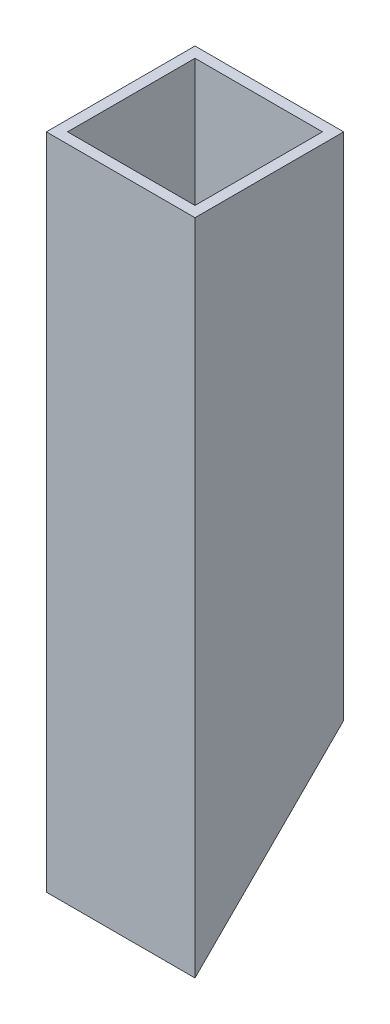
ISO-10303-21;
HEADER;
FILE_DESCRIPTION(('STEP AP214'),'2;1');
FILE_NAME('part.step','',(''),(''),'','','');
FILE_SCHEMA(('AUTOMOTIVE_DESIGN { 1 0 10303 214 1 1 1 1 }'));
ENDSEC;
DATA;
#1=APPLICATION_CONTEXT('core data for automotive mechanical design processes');
#2=APPLICATION_PROTOCOL_DEFINITION('international standard','automotive_design',2000,#1);
#3=PRODUCT_CONTEXT('',#1,'mechanical');
#4=PRODUCT('Part','Part','',(#3));
#5=PRODUCT_RELATED_PRODUCT_CATEGORY('part','',(#4));
#6=PRODUCT_DEFINITION_FORMATION('','',#4);
#7=PRODUCT_DEFINITION_CONTEXT('part definition',#1,'design');
#8=PRODUCT_DEFINITION('design','',#6,#7);
#9=PRODUCT_DEFINITION_SHAPE('','',#8);
#10=(LENGTH_UNIT() NAMED_UNIT(*) SI_UNIT(.MILLI.,.METRE.));
#11=(NAMED_UNIT(*) PLANE_ANGLE_UNIT() SI_UNIT($,.RADIAN.));
#12=(NAMED_UNIT(*) SI_UNIT($,.STERADIAN.) SOLID_ANGLE_UNIT());
#13=UNCERTAINTY_MEASURE_WITH_UNIT(LENGTH_MEASURE(1.E-05),#10,'distance_accuracy_value','');
#14=(GEOMETRIC_REPRESENTATION_CONTEXT(3) GLOBAL_UNCERTAINTY_ASSIGNED_CONTEXT((#13)) GLOBAL_UNIT_ASSIGNED_CONTEXT((#10,
#11,#12)) REPRESENTATION_CONTEXT('',''));
#15=CARTESIAN_POINT('',(0.,0.,0.));
#16=DIRECTION('',(0.,0.,1.));
#17=DIRECTION('',(1.,0.,0.));
#18=AXIS2_PLACEMENT_3D('',#15,#16,#17);
#19=CARTESIAN_POINT('',(0.,196.85,0.));
#20=DIRECTION('',(0.,-1.,0.));
#21=DIRECTION('',(0.,0.,1.));
#22=AXIS2_PLACEMENT_3D('',#19,#20,#21);
#23=PLANE('',#22);
#24=DIRECTION('',(0.,0.,-1.));
#25=VECTOR('',#24,1.);
#26=CARTESIAN_POINT('',(0.,196.85,0.));
#27=LINE('',#26,#25);
#28=CARTESIAN_POINT('',(0.,196.85,44.45));
#29=VERTEX_POINT('',#28);
#30=CARTESIAN_POINT('',(0.,196.85,0.));
#31=VERTEX_POINT('',#30);
#32=EDGE_CURVE('E147',#29,#31,#27,.T.);
#33=ORIENTED_EDGE('',*,*,#32,.F.);
#34=DIRECTION('',(-1.,0.,0.));
#35=VECTOR('',#34,1.);
#36=CARTESIAN_POINT('',(0.,196.85,44.45));
#37=LINE('',#36,#35);
#38=CARTESIAN_POINT('',(44.45,196.85,44.45));
#39=VERTEX_POINT('',#38);
#40=EDGE_CURVE('E158',#39,#29,#37,.T.);
#41=ORIENTED_EDGE('',*,*,#40,.F.);
#42=DIRECTION('',(0.,0.,1.));
#43=VECTOR('',#42,1.);
#44=CARTESIAN_POINT('',(44.45,196.85,0.));
#45=LINE('',#44,#43);
#46=CARTESIAN_POINT('',(44.45,196.85,0.));
#47=VERTEX_POINT('',#46);
#48=EDGE_CURVE('E155',#47,#39,#45,.T.);
#49=ORIENTED_EDGE('',*,*,#48,.F.);
#50=DIRECTION('',(1.,0.,0.));
#51=VECTOR('',#50,1.);
#52=CARTESIAN_POINT('',(0.,196.85,0.));
#53=LINE('',#52,#51);
#54=EDGE_CURVE('E151',#31,#47,#53,.T.);
#55=ORIENTED_EDGE('',*,*,#54,.F.);
#56=EDGE_LOOP('',(#33,#41,#49,#55));
#57=FACE_BOUND('',#56,.T.);
#58=DIRECTION('',(1.,0.,0.));
#59=VECTOR('',#58,1.);
#60=CARTESIAN_POINT('',(3.175,196.85,3.175));
#61=LINE('',#60,#59);
#62=CARTESIAN_POINT('',(3.175,196.85,3.175));
#63=VERTEX_POINT('',#62);
#64=CARTESIAN_POINT('',(41.275,196.85,3.175));
#65=VERTEX_POINT('',#64);
#66=EDGE_CURVE('E124',#63,#65,#61,.T.);
#67=ORIENTED_EDGE('',*,*,#66,.T.);
#68=DIRECTION('',(0.,0.,1.));
#69=VECTOR('',#68,1.);
#70=CARTESIAN_POINT('',(41.275,196.85,3.175));
#71=LINE('',#70,#69);
#72=CARTESIAN_POINT('',(41.275,196.85,41.275));
#73=VERTEX_POINT('',#72);
#74=EDGE_CURVE('E94',#65,#73,#71,.T.);
#75=ORIENTED_EDGE('',*,*,#74,.T.);
#76=DIRECTION('',(-1.,0.,0.));
#77=VECTOR('',#76,1.);
#78=CARTESIAN_POINT('',(3.175,196.85,41.275));
#79=LINE('',#78,#77);
#80=CARTESIAN_POINT('',(3.175,196.85,41.275));
#81=VERTEX_POINT('',#80);
#82=EDGE_CURVE('E135',#73,#81,#79,.T.);
#83=ORIENTED_EDGE('',*,*,#82,.T.);
#84=DIRECTION('',(0.,0.,-1.));
#85=VECTOR('',#84,1.);
#86=CARTESIAN_POINT('',(3.175,196.85,3.175));
#87=LINE('',#86,#85);
#88=EDGE_CURVE('E111',#81,#63,#87,.T.);
#89=ORIENTED_EDGE('',*,*,#88,.T.);
#90=EDGE_LOOP('',(#67,#75,#83,#89));
#91=FACE_BOUND('',#90,.T.);
#92=ADVANCED_FACE('F43',(#57,#91),#23,.F.);
#93=CARTESIAN_POINT('',(0.,196.85,0.));
#94=DIRECTION('',(1.,0.,0.));
#95=DIRECTION('',(0.,0.,1.));
#96=AXIS2_PLACEMENT_3D('',#93,#94,#95);
#97=PLANE('',#96);
#98=DIRECTION('',(0.,-1.,0.));
#99=VECTOR('',#98,1.);
#100=CARTESIAN_POINT('',(0.,196.85,44.45));
#101=LINE('',#100,#99);
#102=CARTESIAN_POINT('',(0.,0.,44.45));
#103=VERTEX_POINT('',#102);
#104=EDGE_CURVE('E117',#29,#103,#101,.T.);
#105=ORIENTED_EDGE('',*,*,#104,.F.);
#106=ORIENTED_EDGE('',*,*,#32,.T.);
#107=DIRECTION('',(0.,-1.,0.));
#108=VECTOR('',#107,1.);
#109=CARTESIAN_POINT('',(0.,196.85,0.));
#110=LINE('',#109,#108);
#111=CARTESIAN_POINT('',(0.,44.45,0.));
#112=VERTEX_POINT('',#111);
#113=EDGE_CURVE('E122',#31,#112,#110,.T.);
#114=ORIENTED_EDGE('',*,*,#113,.T.);
#115=DIRECTION('',(0.,0.707106781186546,-0.707106781186549));
#116=VECTOR('',#115,1.);
#117=CARTESIAN_POINT('',(0.,44.45,0.));
#118=LINE('',#117,#116);
#119=EDGE_CURVE('E11',#103,#112,#118,.T.);
#120=ORIENTED_EDGE('',*,*,#119,.F.);
#121=EDGE_LOOP('',(#105,#106,#114,#120));
#122=FACE_BOUND('',#121,.T.);
#123=ADVANCED_FACE('F215',(#122),#97,.F.);
#124=CARTESIAN_POINT('',(0.,196.85,0.));
#125=DIRECTION('',(0.,0.,1.));
#126=DIRECTION('',(-1.,0.,0.));
#127=AXIS2_PLACEMENT_3D('',#124,#125,#126);
#128=PLANE('',#127);
#129=ORIENTED_EDGE('',*,*,#113,.F.);
#130=ORIENTED_EDGE('',*,*,#54,.T.);
#131=DIRECTION('',(0.,-1.,0.));
#132=VECTOR('',#131,1.);
#133=CARTESIAN_POINT('',(44.45,196.85,0.));
#134=LINE('',#133,#132);
#135=CARTESIAN_POINT('',(44.45,44.45,0.));
#136=VERTEX_POINT('',#135);
#137=EDGE_CURVE('E116',#47,#136,#134,.T.);
#138=ORIENTED_EDGE('',*,*,#137,.T.);
#139=DIRECTION('',(1.,0.,0.));
#140=VECTOR('',#139,1.);
#141=CARTESIAN_POINT('',(44.45,44.45,0.));
#142=LINE('',#141,#140);
#143=EDGE_CURVE('E63',#112,#136,#142,.T.);
#144=ORIENTED_EDGE('',*,*,#143,.F.);
#145=EDGE_LOOP('',(#129,#130,#138,#144));
#146=FACE_BOUND('',#145,.T.);
#147=ADVANCED_FACE('F212',(#146),#128,.F.);
#148=CARTESIAN_POINT('',(44.45,196.85,0.));
#149=DIRECTION('',(-1.,0.,0.));
#150=DIRECTION('',(0.,0.,-1.));
#151=AXIS2_PLACEMENT_3D('',#148,#149,#150);
#152=PLANE('',#151);
#153=ORIENTED_EDGE('',*,*,#137,.F.);
#154=ORIENTED_EDGE('',*,*,#48,.T.);
#155=DIRECTION('',(0.,-1.,0.));
#156=VECTOR('',#155,1.);
#157=CARTESIAN_POINT('',(44.45,196.85,44.45));
#158=LINE('',#157,#156);
#159=CARTESIAN_POINT('',(44.45,0.,44.45));
#160=VERTEX_POINT('',#159);
#161=EDGE_CURVE('E113',#39,#160,#158,.T.);
#162=ORIENTED_EDGE('',*,*,#161,.T.);
#163=DIRECTION('',(0.,-0.707106781186546,0.707106781186549));
#164=VECTOR('',#163,1.);
#165=CARTESIAN_POINT('',(44.45,44.45,0.));
#166=LINE('',#165,#164);
#167=EDGE_CURVE('E54',#136,#160,#166,.T.);
#168=ORIENTED_EDGE('',*,*,#167,.F.);
#169=EDGE_LOOP('',(#153,#154,#162,#168));
#170=FACE_BOUND('',#169,.T.);
#171=ADVANCED_FACE('F185',(#170),#152,.F.);
#172=CARTESIAN_POINT('',(0.,196.85,44.45));
#173=DIRECTION('',(0.,0.,-1.));
#174=DIRECTION('',(1.,0.,0.));
#175=AXIS2_PLACEMENT_3D('',#172,#173,#174);
#176=PLANE('',#175);
#177=DIRECTION('',(-1.,0.,0.));
#178=VECTOR('',#177,1.);
#179=CARTESIAN_POINT('',(0.,0.,44.45));
#180=LINE('',#179,#178);
#181=EDGE_CURVE('E99',#160,#103,#180,.T.);
#182=ORIENTED_EDGE('',*,*,#181,.F.);
#183=ORIENTED_EDGE('',*,*,#161,.F.);
#184=ORIENTED_EDGE('',*,*,#40,.T.);
#185=ORIENTED_EDGE('',*,*,#104,.T.);
#186=EDGE_LOOP('',(#182,#183,#184,#185));
#187=FACE_BOUND('',#186,.T.);
#188=ADVANCED_FACE('F190',(#187),#176,.F.);
#189=CARTESIAN_POINT('',(3.175,196.85,3.175));
#190=DIRECTION('',(0.,0.,1.));
#191=DIRECTION('',(-1.,0.,0.));
#192=AXIS2_PLACEMENT_3D('',#189,#190,#191);
#193=PLANE('',#192);
#194=DIRECTION('',(1.,0.,0.));
#195=VECTOR('',#194,1.);
#196=CARTESIAN_POINT('',(0.,41.275,3.175));
#197=LINE('',#196,#195);
#198=CARTESIAN_POINT('',(3.175,41.275,3.175));
#199=VERTEX_POINT('',#198);
#200=CARTESIAN_POINT('',(41.275,41.275,3.175));
#201=VERTEX_POINT('',#200);
#202=EDGE_CURVE('E47',#199,#201,#197,.T.);
#203=ORIENTED_EDGE('',*,*,#202,.T.);
#204=DIRECTION('',(0.,-1.,0.));
#205=VECTOR('',#204,1.);
#206=CARTESIAN_POINT('',(41.275,196.85,3.175));
#207=LINE('',#206,#205);
#208=EDGE_CURVE('E91',#65,#201,#207,.T.);
#209=ORIENTED_EDGE('',*,*,#208,.F.);
#210=ORIENTED_EDGE('',*,*,#66,.F.);
#211=DIRECTION('',(0.,-1.,0.));
#212=VECTOR('',#211,1.);
#213=CARTESIAN_POINT('',(3.175,196.85,3.175));
#214=LINE('',#213,#212);
#215=EDGE_CURVE('E105',#63,#199,#214,.T.);
#216=ORIENTED_EDGE('',*,*,#215,.T.);
#217=EDGE_LOOP('',(#203,#209,#210,#216));
#218=FACE_BOUND('',#217,.T.);
#219=ADVANCED_FACE('F103',(#218),#193,.T.);
#220=CARTESIAN_POINT('',(41.275,196.85,3.175));
#221=DIRECTION('',(-1.,0.,0.));
#222=DIRECTION('',(0.,0.,-1.));
#223=AXIS2_PLACEMENT_3D('',#220,#221,#222);
#224=PLANE('',#223);
#225=DIRECTION('',(0.,-0.707106781186546,0.707106781186549));
#226=VECTOR('',#225,1.);
#227=CARTESIAN_POINT('',(41.275,44.45,0.));
#228=LINE('',#227,#226);
#229=CARTESIAN_POINT('',(41.275,3.17500000000018,41.275));
#230=VERTEX_POINT('',#229);
#231=EDGE_CURVE('E80',#201,#230,#228,.T.);
#232=ORIENTED_EDGE('',*,*,#231,.T.);
#233=DIRECTION('',(0.,-1.,0.));
#234=VECTOR('',#233,1.);
#235=CARTESIAN_POINT('',(41.275,196.85,41.275));
#236=LINE('',#235,#234);
#237=EDGE_CURVE('E100',#73,#230,#236,.T.);
#238=ORIENTED_EDGE('',*,*,#237,.F.);
#239=ORIENTED_EDGE('',*,*,#74,.F.);
#240=ORIENTED_EDGE('',*,*,#208,.T.);
#241=EDGE_LOOP('',(#232,#238,#239,#240));
#242=FACE_BOUND('',#241,.T.);
#243=ADVANCED_FACE('F92',(#242),#224,.T.);
#244=CARTESIAN_POINT('',(3.175,196.85,41.275));
#245=DIRECTION('',(0.,0.,-1.));
#246=DIRECTION('',(1.,0.,0.));
#247=AXIS2_PLACEMENT_3D('',#244,#245,#246);
#248=PLANE('',#247);
#249=DIRECTION('',(-1.,0.,0.));
#250=VECTOR('',#249,1.);
#251=CARTESIAN_POINT('',(0.,3.17500000000015,41.275));
#252=LINE('',#251,#250);
#253=CARTESIAN_POINT('',(3.175,3.17500000000018,41.275));
#254=VERTEX_POINT('',#253);
#255=EDGE_CURVE('E84',#230,#254,#252,.T.);
#256=ORIENTED_EDGE('',*,*,#255,.T.);
#257=DIRECTION('',(0.,-1.,0.));
#258=VECTOR('',#257,1.);
#259=CARTESIAN_POINT('',(3.175,196.85,41.275));
#260=LINE('',#259,#258);
#261=EDGE_CURVE('E110',#81,#254,#260,.T.);
#262=ORIENTED_EDGE('',*,*,#261,.F.);
#263=ORIENTED_EDGE('',*,*,#82,.F.);
#264=ORIENTED_EDGE('',*,*,#237,.T.);
#265=EDGE_LOOP('',(#256,#262,#263,#264));
#266=FACE_BOUND('',#265,.T.);
#267=ADVANCED_FACE('F207',(#266),#248,.T.);
#268=CARTESIAN_POINT('',(3.175,196.85,3.175));
#269=DIRECTION('',(1.,0.,0.));
#270=DIRECTION('',(0.,0.,1.));
#271=AXIS2_PLACEMENT_3D('',#268,#269,#270);
#272=PLANE('',#271);
#273=DIRECTION('',(0.,0.707106781186546,-0.707106781186549));
#274=VECTOR('',#273,1.);
#275=CARTESIAN_POINT('',(3.175,44.45,0.));
#276=LINE('',#275,#274);
#277=EDGE_CURVE('E126',#254,#199,#276,.T.);
#278=ORIENTED_EDGE('',*,*,#277,.T.);
#279=ORIENTED_EDGE('',*,*,#215,.F.);
#280=ORIENTED_EDGE('',*,*,#88,.F.);
#281=ORIENTED_EDGE('',*,*,#261,.T.);
#282=EDGE_LOOP('',(#278,#279,#280,#281));
#283=FACE_BOUND('',#282,.T.);
#284=ADVANCED_FACE('F206',(#283),#272,.T.);
#285=CARTESIAN_POINT('',(0.,44.45,0.));
#286=DIRECTION('',(0.,-0.707106781186549,-0.707106781186546));
#287=DIRECTION('',(-1.,0.,0.));
#288=AXIS2_PLACEMENT_3D('',#285,#286,#287);
#289=PLANE('',#288);
#290=ORIENTED_EDGE('',*,*,#119,.T.);
#291=ORIENTED_EDGE('',*,*,#143,.T.);
#292=ORIENTED_EDGE('',*,*,#167,.T.);
#293=ORIENTED_EDGE('',*,*,#181,.T.);
#294=EDGE_LOOP('',(#290,#291,#292,#293));
#295=FACE_BOUND('',#294,.T.);
#296=ORIENTED_EDGE('',*,*,#277,.F.);
#297=ORIENTED_EDGE('',*,*,#255,.F.);
#298=ORIENTED_EDGE('',*,*,#231,.F.);
#299=ORIENTED_EDGE('',*,*,#202,.F.);
#300=EDGE_LOOP('',(#296,#297,#298,#299));
#301=FACE_BOUND('',#300,.T.);
#302=ADVANCED_FACE('F45',(#295,#301),#289,.T.);
#303=CLOSED_SHELL('',(#92,#123,#147,#171,#188,#219,#243,#267,#284,#302));
#304=MANIFOLD_SOLID_BREP('B2',#303);
#305=ADVANCED_BREP_SHAPE_REPRESENTATION('',(#18,#304),#14);
#306=SHAPE_DEFINITION_REPRESENTATION(#9,#305);
ENDSEC;
END-ISO-10303-21;
